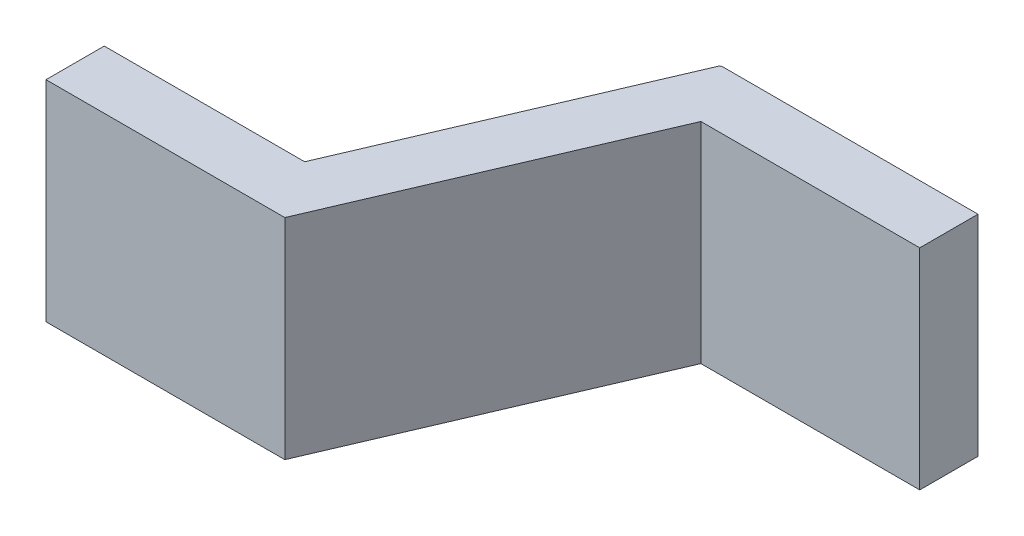
ISO-10303-21;
HEADER;
FILE_DESCRIPTION(('STEP AP214'),'2;1');
FILE_NAME('part.step','',(''),(''),'','','');
FILE_SCHEMA(('AUTOMOTIVE_DESIGN { 1 0 10303 214 1 1 1 1 }'));
ENDSEC;
DATA;
#1=APPLICATION_CONTEXT('core data for automotive mechanical design processes');
#2=APPLICATION_PROTOCOL_DEFINITION('international standard','automotive_design',2000,#1);
#3=PRODUCT_CONTEXT('',#1,'mechanical');
#4=PRODUCT('Part','Part','',(#3));
#5=PRODUCT_RELATED_PRODUCT_CATEGORY('part','',(#4));
#6=PRODUCT_DEFINITION_FORMATION('','',#4);
#7=PRODUCT_DEFINITION_CONTEXT('part definition',#1,'design');
#8=PRODUCT_DEFINITION('design','',#6,#7);
#9=PRODUCT_DEFINITION_SHAPE('','',#8);
#10=(LENGTH_UNIT() NAMED_UNIT(*) SI_UNIT(.MILLI.,.METRE.));
#11=(NAMED_UNIT(*) PLANE_ANGLE_UNIT() SI_UNIT($,.RADIAN.));
#12=(NAMED_UNIT(*) SI_UNIT($,.STERADIAN.) SOLID_ANGLE_UNIT());
#13=UNCERTAINTY_MEASURE_WITH_UNIT(LENGTH_MEASURE(1.E-05),#10,'distance_accuracy_value','');
#14=(GEOMETRIC_REPRESENTATION_CONTEXT(3) GLOBAL_UNCERTAINTY_ASSIGNED_CONTEXT((#13)) GLOBAL_UNIT_ASSIGNED_CONTEXT((#10,
#11,#12)) REPRESENTATION_CONTEXT('',''));
#15=CARTESIAN_POINT('',(0.,0.,0.));
#16=DIRECTION('',(0.,0.,1.));
#17=DIRECTION('',(1.,0.,0.));
#18=AXIS2_PLACEMENT_3D('',#15,#16,#17);
#19=CARTESIAN_POINT('',(11.558086453539,8.22,0.0006058345056003));
#20=DIRECTION('',(-0.919135450912914,0.,-0.393941649073963));
#21=DIRECTION('',(-0.393941649073963,0.,0.919135450912914));
#22=AXIS2_PLACEMENT_3D('',#19,#20,#21);
#23=PLANE('',#22);
#24=DIRECTION('',(0.,1.,0.));
#25=VECTOR('',#24,1.);
#26=CARTESIAN_POINT('',(11.344046008361,8.22,0.5));
#27=LINE('',#26,#25);
#28=CARTESIAN_POINT('',(11.344046008361,8.22,0.5));
#29=VERTEX_POINT('',#28);
#30=CARTESIAN_POINT('',(11.344046008361,8.580000014305,0.5));
#31=VERTEX_POINT('',#30);
#32=EDGE_CURVE('E94',#29,#31,#27,.T.);
#33=ORIENTED_EDGE('',*,*,#32,.T.);
#34=DIRECTION('',(-0.393941649073123,0.,0.919135450913275));
#35=VECTOR('',#34,1.);
#36=CARTESIAN_POINT('',(11.558086453539,8.580000014305,0.000605834505600302));
#37=LINE('',#36,#35);
#38=CARTESIAN_POINT('',(11.558086453539,8.580000014305,0.000605834505577237));
#39=VERTEX_POINT('',#38);
#40=EDGE_CURVE('E121',#39,#31,#37,.T.);
#41=ORIENTED_EDGE('',*,*,#40,.F.);
#42=DIRECTION('',(0.,1.,0.));
#43=VECTOR('',#42,1.);
#44=CARTESIAN_POINT('',(11.558086453539,8.22,0.000605834505554305));
#45=LINE('',#44,#43);
#46=CARTESIAN_POINT('',(11.558086453539,8.22,0.000605834505584969));
#47=VERTEX_POINT('',#46);
#48=EDGE_CURVE('E110',#39,#47,#45,.F.);
#49=ORIENTED_EDGE('',*,*,#48,.T.);
#50=DIRECTION('',(-0.393941649073123,0.,0.919135450913275));
#51=VECTOR('',#50,1.);
#52=CARTESIAN_POINT('',(11.558086453539,8.22,0.000605834505600302));
#53=LINE('',#52,#51);
#54=EDGE_CURVE('E100',#47,#29,#53,.T.);
#55=ORIENTED_EDGE('',*,*,#54,.T.);
#56=EDGE_LOOP('',(#33,#41,#49,#55));
#57=FACE_BOUND('',#56,.T.);
#58=ADVANCED_FACE('F17',(#57),#23,.T.);
#59=CARTESIAN_POINT('',(11.,8.22,0.5));
#60=DIRECTION('',(0.,0.,1.));
#61=DIRECTION('',(1.,0.,0.));
#62=AXIS2_PLACEMENT_3D('',#59,#60,#61);
#63=PLANE('',#62);
#64=DIRECTION('',(1.,0.,0.));
#65=VECTOR('',#64,1.);
#66=CARTESIAN_POINT('',(11.65,8.580000014305,0.5));
#67=LINE('',#66,#65);
#68=CARTESIAN_POINT('',(11.,8.580000014305,0.5));
#69=VERTEX_POINT('',#68);
#70=EDGE_CURVE('E79',#31,#69,#67,.F.);
#71=ORIENTED_EDGE('',*,*,#70,.F.);
#72=ORIENTED_EDGE('',*,*,#32,.F.);
#73=DIRECTION('',(1.,0.,0.));
#74=VECTOR('',#73,1.);
#75=CARTESIAN_POINT('',(11.65,8.22,0.5));
#76=LINE('',#75,#74);
#77=CARTESIAN_POINT('',(11.,8.22,0.5));
#78=VERTEX_POINT('',#77);
#79=EDGE_CURVE('E169',#29,#78,#76,.F.);
#80=ORIENTED_EDGE('',*,*,#79,.T.);
#81=DIRECTION('',(0.,1.,0.));
#82=VECTOR('',#81,1.);
#83=CARTESIAN_POINT('',(11.,8.22,0.5));
#84=LINE('',#83,#82);
#85=EDGE_CURVE('E87',#78,#69,#84,.T.);
#86=ORIENTED_EDGE('',*,*,#85,.T.);
#87=EDGE_LOOP('',(#71,#72,#80,#86));
#88=FACE_BOUND('',#87,.T.);
#89=ADVANCED_FACE('F198',(#88),#63,.F.);
#90=CARTESIAN_POINT('',(11.,8.22,0.5));
#91=DIRECTION('',(1.,0.,0.));
#92=DIRECTION('',(0.,0.,-1.));
#93=AXIS2_PLACEMENT_3D('',#90,#91,#92);
#94=PLANE('',#93);
#95=ORIENTED_EDGE('',*,*,#85,.F.);
#96=DIRECTION('',(0.,0.,1.));
#97=VECTOR('',#96,1.);
#98=CARTESIAN_POINT('',(11.,8.22,0.04));
#99=LINE('',#98,#97);
#100=CARTESIAN_POINT('',(11.,8.22,0.60000000149));
#101=VERTEX_POINT('',#100);
#102=EDGE_CURVE('E153',#78,#101,#99,.T.);
#103=ORIENTED_EDGE('',*,*,#102,.T.);
#104=DIRECTION('',(0.,1.,0.));
#105=VECTOR('',#104,1.);
#106=CARTESIAN_POINT('',(11.,8.22,0.60000000149));
#107=LINE('',#106,#105);
#108=CARTESIAN_POINT('',(11.,8.580000014305,0.60000000149));
#109=VERTEX_POINT('',#108);
#110=EDGE_CURVE('E117',#109,#101,#107,.F.);
#111=ORIENTED_EDGE('',*,*,#110,.F.);
#112=DIRECTION('',(0.,0.,1.));
#113=VECTOR('',#112,1.);
#114=CARTESIAN_POINT('',(11.,8.580000014305,0.04));
#115=LINE('',#114,#113);
#116=EDGE_CURVE('E71',#69,#109,#115,.T.);
#117=ORIENTED_EDGE('',*,*,#116,.F.);
#118=EDGE_LOOP('',(#95,#103,#111,#117));
#119=FACE_BOUND('',#118,.T.);
#120=ADVANCED_FACE('F202',(#119),#94,.F.);
#121=CARTESIAN_POINT('',(11.999999997616,8.22,0.));
#122=DIRECTION('',(1.,0.,0.));
#123=DIRECTION('',(0.,0.,-1.));
#124=AXIS2_PLACEMENT_3D('',#121,#122,#123);
#125=PLANE('',#124);
#126=DIRECTION('',(0.,0.,1.));
#127=VECTOR('',#126,1.);
#128=CARTESIAN_POINT('',(11.999999997616,8.22,0.04));
#129=LINE('',#128,#127);
#130=CARTESIAN_POINT('',(11.999999997616,8.22,0.10000000149));
#131=VERTEX_POINT('',#130);
#132=CARTESIAN_POINT('',(11.999999997616,8.22,0.));
#133=VERTEX_POINT('',#132);
#134=EDGE_CURVE('E179',#131,#133,#129,.F.);
#135=ORIENTED_EDGE('',*,*,#134,.T.);
#136=DIRECTION('',(0.,1.,0.));
#137=VECTOR('',#136,1.);
#138=CARTESIAN_POINT('',(11.999999997616,8.22,0.));
#139=LINE('',#138,#137);
#140=CARTESIAN_POINT('',(11.999999997616,8.580000014305,0.));
#141=VERTEX_POINT('',#140);
#142=EDGE_CURVE('E174',#133,#141,#139,.T.);
#143=ORIENTED_EDGE('',*,*,#142,.T.);
#144=DIRECTION('',(0.,0.,1.));
#145=VECTOR('',#144,1.);
#146=CARTESIAN_POINT('',(11.999999997616,8.580000014305,0.04));
#147=LINE('',#146,#145);
#148=CARTESIAN_POINT('',(11.999999997616,8.580000014305,0.10000000149));
#149=VERTEX_POINT('',#148);
#150=EDGE_CURVE('E155',#149,#141,#147,.F.);
#151=ORIENTED_EDGE('',*,*,#150,.F.);
#152=DIRECTION('',(0.,1.,0.));
#153=VECTOR('',#152,1.);
#154=CARTESIAN_POINT('',(11.999999997616,8.22,0.10000000149));
#155=LINE('',#154,#153);
#156=EDGE_CURVE('E125',#131,#149,#155,.T.);
#157=ORIENTED_EDGE('',*,*,#156,.F.);
#158=EDGE_LOOP('',(#135,#143,#151,#157));
#159=FACE_BOUND('',#158,.T.);
#160=ADVANCED_FACE('F228',(#159),#125,.T.);
#161=CARTESIAN_POINT('',(11.56,8.22,0.));
#162=DIRECTION('',(0.,0.,1.));
#163=DIRECTION('',(1.,0.,0.));
#164=AXIS2_PLACEMENT_3D('',#161,#162,#163);
#165=PLANE('',#164);
#166=DIRECTION('',(1.,0.,0.));
#167=VECTOR('',#166,1.);
#168=CARTESIAN_POINT('',(11.65,8.22,0.));
#169=LINE('',#168,#167);
#170=CARTESIAN_POINT('',(11.56,8.22,0.));
#171=VERTEX_POINT('',#170);
#172=EDGE_CURVE('E150',#133,#171,#169,.F.);
#173=ORIENTED_EDGE('',*,*,#172,.T.);
#174=DIRECTION('',(0.,1.,0.));
#175=VECTOR('',#174,1.);
#176=CARTESIAN_POINT('',(11.56,8.22,0.));
#177=LINE('',#176,#175);
#178=CARTESIAN_POINT('',(11.56,8.580000014305,0.));
#179=VERTEX_POINT('',#178);
#180=EDGE_CURVE('E164',#171,#179,#177,.T.);
#181=ORIENTED_EDGE('',*,*,#180,.T.);
#182=DIRECTION('',(1.,0.,0.));
#183=VECTOR('',#182,1.);
#184=CARTESIAN_POINT('',(11.65,8.580000014305,0.));
#185=LINE('',#184,#183);
#186=EDGE_CURVE('E154',#141,#179,#185,.F.);
#187=ORIENTED_EDGE('',*,*,#186,.F.);
#188=ORIENTED_EDGE('',*,*,#142,.F.);
#189=EDGE_LOOP('',(#173,#181,#187,#188));
#190=FACE_BOUND('',#189,.T.);
#191=ADVANCED_FACE('F232',(#190),#165,.F.);
#192=CARTESIAN_POINT('',(11.56,8.22,0.));
#193=DIRECTION('',(1.,0.,0.));
#194=DIRECTION('',(0.,0.,-1.));
#195=AXIS2_PLACEMENT_3D('',#192,#193,#194);
#196=PLANE('',#195);
#197=DIRECTION('',(0.,1.,0.));
#198=VECTOR('',#197,1.);
#199=CARTESIAN_POINT('',(11.56,8.22,0.00142598092431268));
#200=LINE('',#199,#198);
#201=CARTESIAN_POINT('',(11.56,8.22,0.00142598092431734));
#202=VERTEX_POINT('',#201);
#203=CARTESIAN_POINT('',(11.56,8.580000014305,0.00142598092431734));
#204=VERTEX_POINT('',#203);
#205=EDGE_CURVE('E118',#202,#204,#200,.T.);
#206=ORIENTED_EDGE('',*,*,#205,.T.);
#207=DIRECTION('',(0.,0.,1.));
#208=VECTOR('',#207,1.);
#209=CARTESIAN_POINT('',(11.56,8.580000014305,0.04));
#210=LINE('',#209,#208);
#211=EDGE_CURVE('E123',#179,#204,#210,.T.);
#212=ORIENTED_EDGE('',*,*,#211,.F.);
#213=ORIENTED_EDGE('',*,*,#180,.F.);
#214=DIRECTION('',(0.,0.,-1.));
#215=VECTOR('',#214,1.);
#216=CARTESIAN_POINT('',(11.56,8.22,0.));
#217=LINE('',#216,#215);
#218=EDGE_CURVE('E147',#171,#202,#217,.F.);
#219=ORIENTED_EDGE('',*,*,#218,.T.);
#220=EDGE_LOOP('',(#206,#212,#213,#219));
#221=FACE_BOUND('',#220,.T.);
#222=ADVANCED_FACE('F234',(#221),#196,.F.);
#223=CARTESIAN_POINT('',(11.65,8.22,0.04));
#224=DIRECTION('',(-0.393941649073963,0.,0.919135450912914));
#225=DIRECTION('',(0.919135450912914,0.,0.393941649073963));
#226=AXIS2_PLACEMENT_3D('',#223,#224,#225);
#227=PLANE('',#226);
#228=DIRECTION('',(-0.919135450920459,0.,-0.393941649056361));
#229=VECTOR('',#228,1.);
#230=CARTESIAN_POINT('',(11.56,8.580000014305,0.001425980924322));
#231=LINE('',#230,#229);
#232=EDGE_CURVE('E113',#204,#39,#231,.T.);
#233=ORIENTED_EDGE('',*,*,#232,.F.);
#234=ORIENTED_EDGE('',*,*,#205,.F.);
#235=DIRECTION('',(-0.919135450920459,0.,-0.393941649056361));
#236=VECTOR('',#235,1.);
#237=CARTESIAN_POINT('',(11.56,8.22,0.001425980924322));
#238=LINE('',#237,#236);
#239=EDGE_CURVE('E114',#202,#47,#238,.T.);
#240=ORIENTED_EDGE('',*,*,#239,.T.);
#241=ORIENTED_EDGE('',*,*,#48,.F.);
#242=EDGE_LOOP('',(#233,#234,#240,#241));
#243=FACE_BOUND('',#242,.T.);
#244=ADVANCED_FACE('F112',(#243),#227,.F.);
#245=CARTESIAN_POINT('',(11.,8.22,0.60000000149));
#246=DIRECTION('',(0.,0.,1.));
#247=DIRECTION('',(1.,0.,0.));
#248=AXIS2_PLACEMENT_3D('',#245,#246,#247);
#249=PLANE('',#248);
#250=DIRECTION('',(0.,1.,0.));
#251=VECTOR('',#250,1.);
#252=CARTESIAN_POINT('',(11.4099838806682,8.22,0.60000000149));
#253=LINE('',#252,#251);
#254=CARTESIAN_POINT('',(11.4099838806682,8.22,0.60000000149));
#255=VERTEX_POINT('',#254);
#256=CARTESIAN_POINT('',(11.4099838806682,8.580000014305,0.60000000149));
#257=VERTEX_POINT('',#256);
#258=EDGE_CURVE('E144',#255,#257,#253,.T.);
#259=ORIENTED_EDGE('',*,*,#258,.T.);
#260=DIRECTION('',(1.,0.,0.));
#261=VECTOR('',#260,1.);
#262=CARTESIAN_POINT('',(11.65,8.580000014305,0.60000000149));
#263=LINE('',#262,#261);
#264=EDGE_CURVE('E20',#109,#257,#263,.T.);
#265=ORIENTED_EDGE('',*,*,#264,.F.);
#266=ORIENTED_EDGE('',*,*,#110,.T.);
#267=DIRECTION('',(1.,0.,0.));
#268=VECTOR('',#267,1.);
#269=CARTESIAN_POINT('',(11.,8.22,0.60000000149));
#270=LINE('',#269,#268);
#271=EDGE_CURVE('E151',#101,#255,#270,.T.);
#272=ORIENTED_EDGE('',*,*,#271,.T.);
#273=EDGE_LOOP('',(#259,#265,#266,#272));
#274=FACE_BOUND('',#273,.T.);
#275=ADVANCED_FACE('F205',(#274),#249,.T.);
#276=CARTESIAN_POINT('',(11.65,8.580000014305,0.04));
#277=DIRECTION('',(0.,1.,0.));
#278=DIRECTION('',(0.,0.,1.));
#279=AXIS2_PLACEMENT_3D('',#276,#277,#278);
#280=PLANE('',#279);
#281=ORIENTED_EDGE('',*,*,#211,.T.);
#282=ORIENTED_EDGE('',*,*,#232,.T.);
#283=ORIENTED_EDGE('',*,*,#40,.T.);
#284=ORIENTED_EDGE('',*,*,#70,.T.);
#285=ORIENTED_EDGE('',*,*,#116,.T.);
#286=ORIENTED_EDGE('',*,*,#264,.T.);
#287=DIRECTION('',(-0.393941649073964,0.,0.919135450912914));
#288=VECTOR('',#287,1.);
#289=CARTESIAN_POINT('',(11.6242839866442,8.580000014305,0.100000001490094));
#290=LINE('',#289,#288);
#291=CARTESIAN_POINT('',(11.6242839866442,8.580000014305,0.100000001490047));
#292=VERTEX_POINT('',#291);
#293=EDGE_CURVE('E141',#257,#292,#290,.F.);
#294=ORIENTED_EDGE('',*,*,#293,.T.);
#295=DIRECTION('',(1.,0.,0.));
#296=VECTOR('',#295,1.);
#297=CARTESIAN_POINT('',(11.56,8.580000014305,0.10000000149));
#298=LINE('',#297,#296);
#299=EDGE_CURVE('E170',#149,#292,#298,.F.);
#300=ORIENTED_EDGE('',*,*,#299,.F.);
#301=ORIENTED_EDGE('',*,*,#150,.T.);
#302=ORIENTED_EDGE('',*,*,#186,.T.);
#303=EDGE_LOOP('',(#281,#282,#283,#284,#285,#286,#294,#300,#301,#302));
#304=FACE_BOUND('',#303,.T.);
#305=ADVANCED_FACE('F120',(#304),#280,.T.);
#306=CARTESIAN_POINT('',(11.56,8.22,0.10000000149));
#307=DIRECTION('',(0.,0.,1.));
#308=DIRECTION('',(1.,0.,0.));
#309=AXIS2_PLACEMENT_3D('',#306,#307,#308);
#310=PLANE('',#309);
#311=ORIENTED_EDGE('',*,*,#299,.T.);
#312=DIRECTION('',(0.,1.,0.));
#313=VECTOR('',#312,1.);
#314=CARTESIAN_POINT('',(11.6242839866442,8.22,0.100000001490094));
#315=LINE('',#314,#313);
#316=CARTESIAN_POINT('',(11.6242839866442,8.22,0.100000001490047));
#317=VERTEX_POINT('',#316);
#318=EDGE_CURVE('E26',#292,#317,#315,.F.);
#319=ORIENTED_EDGE('',*,*,#318,.T.);
#320=DIRECTION('',(1.,0.,0.));
#321=VECTOR('',#320,1.);
#322=CARTESIAN_POINT('',(11.65,8.22,0.10000000149));
#323=LINE('',#322,#321);
#324=EDGE_CURVE('E34',#317,#131,#323,.T.);
#325=ORIENTED_EDGE('',*,*,#324,.T.);
#326=ORIENTED_EDGE('',*,*,#156,.T.);
#327=EDGE_LOOP('',(#311,#319,#325,#326));
#328=FACE_BOUND('',#327,.T.);
#329=ADVANCED_FACE('F223',(#328),#310,.T.);
#330=CARTESIAN_POINT('',(11.65,8.22,0.04));
#331=DIRECTION('',(0.,1.,0.));
#332=DIRECTION('',(0.,0.,1.));
#333=AXIS2_PLACEMENT_3D('',#330,#331,#332);
#334=PLANE('',#333);
#335=ORIENTED_EDGE('',*,*,#218,.F.);
#336=ORIENTED_EDGE('',*,*,#172,.F.);
#337=ORIENTED_EDGE('',*,*,#134,.F.);
#338=ORIENTED_EDGE('',*,*,#324,.F.);
#339=DIRECTION('',(0.393941649073964,0.,-0.919135450912914));
#340=VECTOR('',#339,1.);
#341=CARTESIAN_POINT('',(11.4098164411035,8.22,0.600390667570103));
#342=LINE('',#341,#340);
#343=EDGE_CURVE('E11',#317,#255,#342,.F.);
#344=ORIENTED_EDGE('',*,*,#343,.T.);
#345=ORIENTED_EDGE('',*,*,#271,.F.);
#346=ORIENTED_EDGE('',*,*,#102,.F.);
#347=ORIENTED_EDGE('',*,*,#79,.F.);
#348=ORIENTED_EDGE('',*,*,#54,.F.);
#349=ORIENTED_EDGE('',*,*,#239,.F.);
#350=EDGE_LOOP('',(#335,#336,#337,#338,#344,#345,#346,#347,#348,#349));
#351=FACE_BOUND('',#350,.T.);
#352=ADVANCED_FACE('F200',(#351),#334,.F.);
#353=CARTESIAN_POINT('',(11.65,8.22,0.04));
#354=DIRECTION('',(-0.919135450912914,0.,-0.393941649073963));
#355=DIRECTION('',(-0.393941649073963,0.,0.919135450912914));
#356=AXIS2_PLACEMENT_3D('',#353,#354,#355);
#357=PLANE('',#356);
#358=ORIENTED_EDGE('',*,*,#318,.F.);
#359=ORIENTED_EDGE('',*,*,#293,.F.);
#360=ORIENTED_EDGE('',*,*,#258,.F.);
#361=ORIENTED_EDGE('',*,*,#343,.F.);
#362=EDGE_LOOP('',(#358,#359,#360,#361));
#363=FACE_BOUND('',#362,.T.);
#364=ADVANCED_FACE('F210',(#363),#357,.F.);
#365=CLOSED_SHELL('',(#58,#89,#120,#160,#191,#222,#244,#275,#305,#329,#352,#364));
#366=MANIFOLD_SOLID_BREP('B1',#365);
#367=ADVANCED_BREP_SHAPE_REPRESENTATION('',(#18,#366),#14);
#368=SHAPE_DEFINITION_REPRESENTATION(#9,#367);
ENDSEC;
END-ISO-10303-21;
